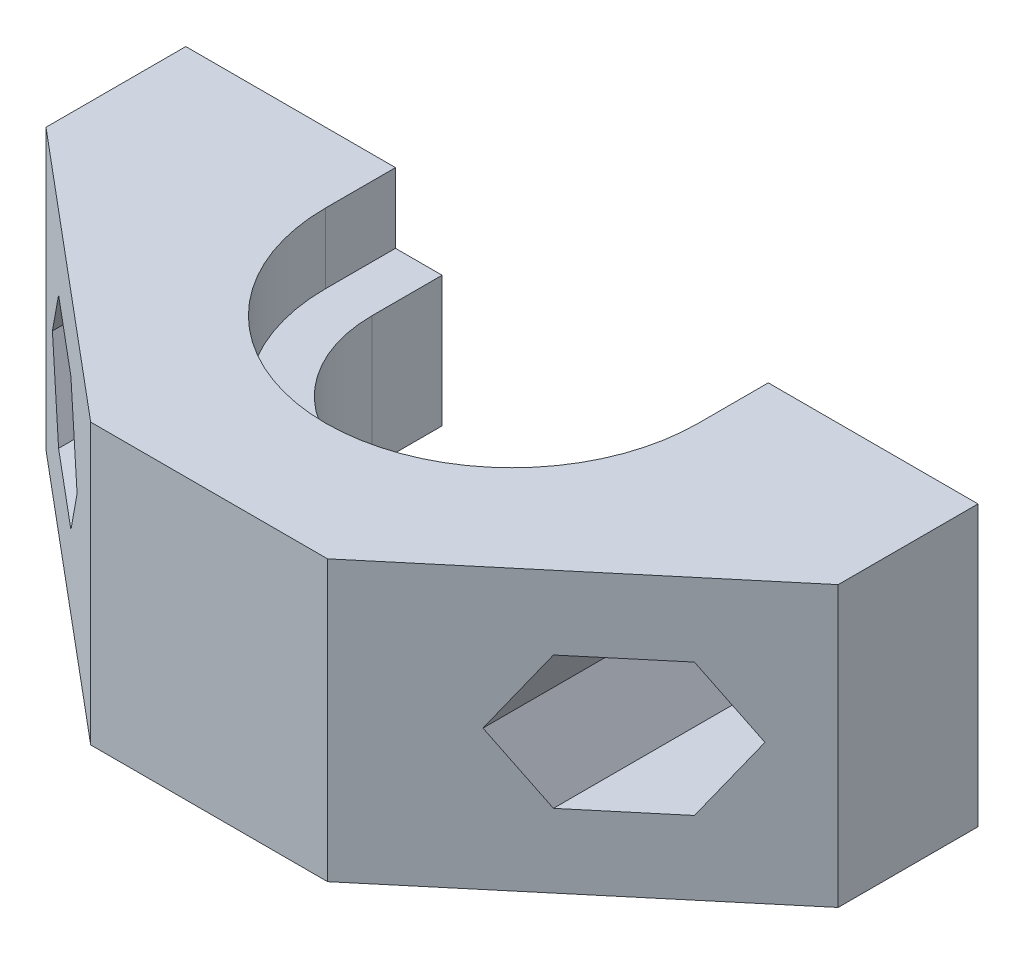
ISO-10303-21;
HEADER;
FILE_DESCRIPTION(('STEP AP214'),'2;1');
FILE_NAME('part.step','',(''),(''),'','','');
FILE_SCHEMA(('AUTOMOTIVE_DESIGN { 1 0 10303 214 1 1 1 1 }'));
ENDSEC;
DATA;
#1=APPLICATION_CONTEXT('core data for automotive mechanical design processes');
#2=APPLICATION_PROTOCOL_DEFINITION('international standard','automotive_design',2000,#1);
#3=PRODUCT_CONTEXT('',#1,'mechanical');
#4=PRODUCT('Part','Part','',(#3));
#5=PRODUCT_RELATED_PRODUCT_CATEGORY('part','',(#4));
#6=PRODUCT_DEFINITION_FORMATION('','',#4);
#7=PRODUCT_DEFINITION_CONTEXT('part definition',#1,'design');
#8=PRODUCT_DEFINITION('design','',#6,#7);
#9=PRODUCT_DEFINITION_SHAPE('','',#8);
#10=(LENGTH_UNIT() NAMED_UNIT(*) SI_UNIT(.MILLI.,.METRE.));
#11=(NAMED_UNIT(*) PLANE_ANGLE_UNIT() SI_UNIT($,.RADIAN.));
#12=(NAMED_UNIT(*) SI_UNIT($,.STERADIAN.) SOLID_ANGLE_UNIT());
#13=UNCERTAINTY_MEASURE_WITH_UNIT(LENGTH_MEASURE(1.E-05),#10,'distance_accuracy_value','');
#14=(GEOMETRIC_REPRESENTATION_CONTEXT(3) GLOBAL_UNCERTAINTY_ASSIGNED_CONTEXT((#13)) GLOBAL_UNIT_ASSIGNED_CONTEXT((#10,
#11,#12)) REPRESENTATION_CONTEXT('',''));
#15=CARTESIAN_POINT('',(0.,0.,0.));
#16=DIRECTION('',(0.,0.,1.));
#17=DIRECTION('',(1.,0.,0.));
#18=AXIS2_PLACEMENT_3D('',#15,#16,#17);
#19=CARTESIAN_POINT('',(0.,3.4,0.));
#20=DIRECTION('',(0.,-1.,0.));
#21=DIRECTION('',(0.,0.,-1.));
#22=AXIS2_PLACEMENT_3D('',#19,#20,#21);
#23=CYLINDRICAL_SURFACE('',#22,8.);
#24=CARTESIAN_POINT('',(0.,0.,0.));
#25=DIRECTION('',(0.,-1.,0.));
#26=DIRECTION('',(0.,0.,1.));
#27=AXIS2_PLACEMENT_3D('',#24,#25,#26);
#28=CIRCLE('',#27,8.);
#29=CARTESIAN_POINT('',(8.,0.,0.));
#30=VERTEX_POINT('',#29);
#31=CARTESIAN_POINT('',(-8.,0.,0.));
#32=VERTEX_POINT('',#31);
#33=EDGE_CURVE('E503',#30,#32,#28,.T.);
#34=ORIENTED_EDGE('',*,*,#33,.T.);
#35=DIRECTION('',(0.,-1.,0.));
#36=VECTOR('',#35,1.);
#37=CARTESIAN_POINT('',(-8.,3.4,0.));
#38=LINE('',#37,#36);
#39=CARTESIAN_POINT('',(-8.,3.4,0.));
#40=VERTEX_POINT('',#39);
#41=EDGE_CURVE('E11',#40,#32,#38,.T.);
#42=ORIENTED_EDGE('',*,*,#41,.F.);
#43=CARTESIAN_POINT('',(0.,3.4,0.));
#44=DIRECTION('',(0.,-1.,0.));
#45=DIRECTION('',(0.,0.,1.));
#46=AXIS2_PLACEMENT_3D('',#43,#44,#45);
#47=CIRCLE('',#46,8.);
#48=CARTESIAN_POINT('',(8.,3.4,0.));
#49=VERTEX_POINT('',#48);
#50=EDGE_CURVE('E504',#49,#40,#47,.T.);
#51=ORIENTED_EDGE('',*,*,#50,.F.);
#52=DIRECTION('',(0.,-1.,0.));
#53=VECTOR('',#52,1.);
#54=CARTESIAN_POINT('',(8.,3.4,0.));
#55=LINE('',#54,#53);
#56=EDGE_CURVE('E521',#49,#30,#55,.T.);
#57=ORIENTED_EDGE('',*,*,#56,.T.);
#58=EDGE_LOOP('',(#34,#42,#51,#57));
#59=FACE_BOUND('',#58,.T.);
#60=ADVANCED_FACE('F39',(#59),#23,.F.);
#61=CARTESIAN_POINT('',(-8.,3.4,-3.));
#62=DIRECTION('',(-1.,0.,0.));
#63=DIRECTION('',(0.,0.,1.));
#64=AXIS2_PLACEMENT_3D('',#61,#62,#63);
#65=PLANE('',#64);
#66=DIRECTION('',(0.,0.,-1.));
#67=VECTOR('',#66,1.);
#68=CARTESIAN_POINT('',(-8.,0.,-3.));
#69=LINE('',#68,#67);
#70=CARTESIAN_POINT('',(-8.,0.,-3.));
#71=VERTEX_POINT('',#70);
#72=EDGE_CURVE('E525',#32,#71,#69,.T.);
#73=ORIENTED_EDGE('',*,*,#72,.T.);
#74=DIRECTION('',(0.,-1.,0.));
#75=VECTOR('',#74,1.);
#76=CARTESIAN_POINT('',(-8.,3.4,-3.));
#77=LINE('',#76,#75);
#78=CARTESIAN_POINT('',(-8.,3.4,-3.));
#79=VERTEX_POINT('',#78);
#80=EDGE_CURVE('E47',#79,#71,#77,.T.);
#81=ORIENTED_EDGE('',*,*,#80,.F.);
#82=DIRECTION('',(0.,0.,-1.));
#83=VECTOR('',#82,1.);
#84=CARTESIAN_POINT('',(-8.,3.4,-3.));
#85=LINE('',#84,#83);
#86=EDGE_CURVE('E508',#40,#79,#85,.T.);
#87=ORIENTED_EDGE('',*,*,#86,.F.);
#88=ORIENTED_EDGE('',*,*,#41,.T.);
#89=EDGE_LOOP('',(#73,#81,#87,#88));
#90=FACE_BOUND('',#89,.T.);
#91=ADVANCED_FACE('F650',(#90),#65,.F.);
#92=CARTESIAN_POINT('',(-17.,3.4,-3.));
#93=DIRECTION('',(0.,0.,1.));
#94=DIRECTION('',(1.,0.,0.));
#95=AXIS2_PLACEMENT_3D('',#92,#93,#94);
#96=PLANE('',#95);
#97=CARTESIAN_POINT('',(-12.,6.,-3.));
#98=DIRECTION('',(0.,0.,-1.));
#99=DIRECTION('',(-1.,0.,0.));
#100=AXIS2_PLACEMENT_3D('',#97,#98,#99);
#101=CIRCLE('',#100,1.65);
#102=CARTESIAN_POINT('',(-13.65,6.,-3.));
#103=VERTEX_POINT('',#102);
#104=EDGE_CURVE('E382',#103,#103,#101,.T.);
#105=ORIENTED_EDGE('',*,*,#104,.F.);
#106=EDGE_LOOP('',(#105));
#107=FACE_BOUND('',#106,.T.);
#108=DIRECTION('',(-1.,0.,0.));
#109=VECTOR('',#108,1.);
#110=CARTESIAN_POINT('',(-17.,0.,-3.));
#111=LINE('',#110,#109);
#112=CARTESIAN_POINT('',(-17.,0.,-3.));
#113=VERTEX_POINT('',#112);
#114=EDGE_CURVE('E528',#71,#113,#111,.T.);
#115=ORIENTED_EDGE('',*,*,#114,.T.);
#116=DIRECTION('',(0.,-1.,0.));
#117=VECTOR('',#116,1.);
#118=CARTESIAN_POINT('',(-17.,3.4,-3.));
#119=LINE('',#118,#117);
#120=CARTESIAN_POINT('',(-17.,12.,-3.));
#121=VERTEX_POINT('',#120);
#122=EDGE_CURVE('E586',#121,#113,#119,.T.);
#123=ORIENTED_EDGE('',*,*,#122,.F.);
#124=DIRECTION('',(-1.,0.,0.));
#125=VECTOR('',#124,1.);
#126=CARTESIAN_POINT('',(-8.,12.,-3.));
#127=LINE('',#126,#125);
#128=CARTESIAN_POINT('',(-8.,12.,-3.));
#129=VERTEX_POINT('',#128);
#130=EDGE_CURVE('E398',#129,#121,#127,.T.);
#131=ORIENTED_EDGE('',*,*,#130,.F.);
#132=DIRECTION('',(0.,-1.,0.));
#133=VECTOR('',#132,1.);
#134=CARTESIAN_POINT('',(-8.,12.,-3.));
#135=LINE('',#134,#133);
#136=CARTESIAN_POINT('',(-8.,9.,-3.));
#137=VERTEX_POINT('',#136);
#138=EDGE_CURVE('E446',#129,#137,#135,.T.);
#139=ORIENTED_EDGE('',*,*,#138,.T.);
#140=DIRECTION('',(-1.,0.,0.));
#141=VECTOR('',#140,1.);
#142=CARTESIAN_POINT('',(-6.,9.,-3.));
#143=LINE('',#142,#141);
#144=CARTESIAN_POINT('',(-6.,9.,-3.));
#145=VERTEX_POINT('',#144);
#146=EDGE_CURVE('E463',#145,#137,#143,.T.);
#147=ORIENTED_EDGE('',*,*,#146,.F.);
#148=DIRECTION('',(0.,-1.,0.));
#149=VECTOR('',#148,1.);
#150=CARTESIAN_POINT('',(-6.,9.,-3.));
#151=LINE('',#150,#149);
#152=CARTESIAN_POINT('',(-6.,3.4,-3.));
#153=VERTEX_POINT('',#152);
#154=EDGE_CURVE('E495',#145,#153,#151,.T.);
#155=ORIENTED_EDGE('',*,*,#154,.T.);
#156=DIRECTION('',(-1.,0.,0.));
#157=VECTOR('',#156,1.);
#158=CARTESIAN_POINT('',(-6.,3.4,-3.));
#159=LINE('',#158,#157);
#160=EDGE_CURVE('E479',#153,#79,#159,.T.);
#161=ORIENTED_EDGE('',*,*,#160,.T.);
#162=ORIENTED_EDGE('',*,*,#80,.T.);
#163=EDGE_LOOP('',(#115,#123,#131,#139,#147,#155,#161,#162));
#164=FACE_BOUND('',#163,.T.);
#165=ADVANCED_FACE('F593',(#107,#164),#96,.F.);
#166=CARTESIAN_POINT('',(-17.,3.4,3.));
#167=DIRECTION('',(1.,0.,0.));
#168=DIRECTION('',(0.,0.,-1.));
#169=AXIS2_PLACEMENT_3D('',#166,#167,#168);
#170=PLANE('',#169);
#171=DIRECTION('',(0.,0.,1.));
#172=VECTOR('',#171,1.);
#173=CARTESIAN_POINT('',(-17.,0.,3.));
#174=LINE('',#173,#172);
#175=CARTESIAN_POINT('',(-17.,0.,3.));
#176=VERTEX_POINT('',#175);
#177=EDGE_CURVE('E531',#113,#176,#174,.T.);
#178=ORIENTED_EDGE('',*,*,#177,.T.);
#179=DIRECTION('',(0.,-1.,0.));
#180=VECTOR('',#179,1.);
#181=CARTESIAN_POINT('',(-17.,3.4,3.));
#182=LINE('',#181,#180);
#183=CARTESIAN_POINT('',(-17.,12.,3.));
#184=VERTEX_POINT('',#183);
#185=EDGE_CURVE('E582',#184,#176,#182,.T.);
#186=ORIENTED_EDGE('',*,*,#185,.F.);
#187=DIRECTION('',(0.,0.,1.));
#188=VECTOR('',#187,1.);
#189=CARTESIAN_POINT('',(-17.,12.,-3.));
#190=LINE('',#189,#188);
#191=EDGE_CURVE('E402',#121,#184,#190,.T.);
#192=ORIENTED_EDGE('',*,*,#191,.F.);
#193=ORIENTED_EDGE('',*,*,#122,.T.);
#194=EDGE_LOOP('',(#178,#186,#192,#193));
#195=FACE_BOUND('',#194,.T.);
#196=ADVANCED_FACE('F603',(#195),#170,.F.);
#197=CARTESIAN_POINT('',(-17.,3.4,3.));
#198=DIRECTION('',(0.64278760968654,0.,-0.766044443118977));
#199=DIRECTION('',(-0.766044443118977,0.,-0.64278760968654));
#200=AXIS2_PLACEMENT_3D('',#197,#198,#199);
#201=PLANE('',#200);
#202=DIRECTION('',(-0.461065123950812,0.79858822028085,-0.386879575455835));
#203=VECTOR('',#202,1.);
#204=CARTESIAN_POINT('',(-9.5652693870053,7.48292287554986,9.23847971526631));
#205=LINE('',#204,#203);
#206=CARTESIAN_POINT('',(-8.70910346561913,6.,9.956888224128));
#207=VERTEX_POINT('',#206);
#208=CARTESIAN_POINT('',(-10.3545517328096,8.85,8.5761931900072));
#209=VERTEX_POINT('',#208);
#210=EDGE_CURVE('E269',#207,#209,#205,.T.);
#211=ORIENTED_EDGE('',*,*,#210,.F.);
#212=DIRECTION('',(0.461065123950813,0.79858822028085,0.386879575455835));
#213=VECTOR('',#212,1.);
#214=CARTESIAN_POINT('',(-8.16610491528139,6.94050107762122,10.4125181074462));
#215=LINE('',#214,#213);
#216=CARTESIAN_POINT('',(-10.3545517328096,3.15,8.5761931900072));
#217=VERTEX_POINT('',#216);
#218=EDGE_CURVE('E246',#217,#207,#215,.T.);
#219=ORIENTED_EDGE('',*,*,#218,.F.);
#220=DIRECTION('',(0.766044443118977,0.,0.64278760968654));
#221=VECTOR('',#220,1.);
#222=CARTESIAN_POINT('',(-8.17575970677851,3.15,10.4044167754619));
#223=LINE('',#222,#221);
#224=CARTESIAN_POINT('',(-13.6454482671904,3.15,5.81480312176562));
#225=VERTEX_POINT('',#224);
#226=EDGE_CURVE('E258',#225,#217,#223,.T.);
#227=ORIENTED_EDGE('',*,*,#226,.F.);
#228=DIRECTION('',(0.461065123950812,-0.79858822028085,0.386879575455835));
#229=VECTOR('',#228,1.);
#230=CARTESIAN_POINT('',(-12.3635983304531,0.929770781892,6.89040293090654));
#231=LINE('',#230,#229);
#232=CARTESIAN_POINT('',(-15.2908965343809,6.,4.43410808764483));
#233=VERTEX_POINT('',#232);
#234=EDGE_CURVE('E54',#233,#225,#231,.T.);
#235=ORIENTED_EDGE('',*,*,#234,.F.);
#236=DIRECTION('',(-0.461065123950813,-0.798588220280849,-0.386879575455835));
#237=VECTOR('',#236,1.);
#238=CARTESIAN_POINT('',(-13.762762802177,8.64680526493693,5.71636453872665));
#239=LINE('',#238,#237);
#240=CARTESIAN_POINT('',(-13.6454482671904,8.85,5.81480312176562));
#241=VERTEX_POINT('',#240);
#242=EDGE_CURVE('E1005',#241,#233,#239,.T.);
#243=ORIENTED_EDGE('',*,*,#242,.F.);
#244=DIRECTION('',(-0.766044443118977,0.,-0.64278760968654));
#245=VECTOR('',#244,1.);
#246=CARTESIAN_POINT('',(-10.1069370670118,8.85,8.78396656475223));
#247=LINE('',#246,#245);
#248=EDGE_CURVE('E276',#209,#241,#247,.T.);
#249=ORIENTED_EDGE('',*,*,#248,.F.);
#250=EDGE_LOOP('',(#211,#219,#227,#235,#243,#249));
#251=FACE_BOUND('',#250,.T.);
#252=DIRECTION('',(0.766044443118977,0.,0.64278760968654));
#253=VECTOR('',#252,1.);
#254=CARTESIAN_POINT('',(-17.,0.,3.));
#255=LINE('',#254,#253);
#256=CARTESIAN_POINT('',(-5.08246407405794,0.,13.));
#257=VERTEX_POINT('',#256);
#258=EDGE_CURVE('E534',#176,#257,#255,.T.);
#259=ORIENTED_EDGE('',*,*,#258,.T.);
#260=DIRECTION('',(0.,-1.,0.));
#261=VECTOR('',#260,1.);
#262=CARTESIAN_POINT('',(-5.08246407405794,3.4,13.));
#263=LINE('',#262,#261);
#264=CARTESIAN_POINT('',(-5.08246407405794,12.,13.));
#265=VERTEX_POINT('',#264);
#266=EDGE_CURVE('E578',#265,#257,#263,.T.);
#267=ORIENTED_EDGE('',*,*,#266,.F.);
#268=DIRECTION('',(0.766044443118977,0.,0.64278760968654));
#269=VECTOR('',#268,1.);
#270=CARTESIAN_POINT('',(-17.,12.,3.));
#271=LINE('',#270,#269);
#272=EDGE_CURVE('E406',#184,#265,#271,.T.);
#273=ORIENTED_EDGE('',*,*,#272,.F.);
#274=ORIENTED_EDGE('',*,*,#185,.T.);
#275=EDGE_LOOP('',(#259,#267,#273,#274));
#276=FACE_BOUND('',#275,.T.);
#277=ADVANCED_FACE('F265',(#251,#276),#201,.F.);
#278=CARTESIAN_POINT('',(-5.08246407405794,3.4,13.));
#279=DIRECTION('',(0.,0.,-1.));
#280=DIRECTION('',(-1.,0.,0.));
#281=AXIS2_PLACEMENT_3D('',#278,#279,#280);
#282=PLANE('',#281);
#283=DIRECTION('',(1.,0.,0.));
#284=VECTOR('',#283,1.);
#285=CARTESIAN_POINT('',(-5.08246407405794,0.,13.));
#286=LINE('',#285,#284);
#287=CARTESIAN_POINT('',(5.08246407405793,0.,13.));
#288=VERTEX_POINT('',#287);
#289=EDGE_CURVE('E537',#257,#288,#286,.T.);
#290=ORIENTED_EDGE('',*,*,#289,.T.);
#291=DIRECTION('',(0.,-1.,0.));
#292=VECTOR('',#291,1.);
#293=CARTESIAN_POINT('',(5.08246407405793,3.4,13.));
#294=LINE('',#293,#292);
#295=CARTESIAN_POINT('',(5.08246407405793,12.,13.));
#296=VERTEX_POINT('',#295);
#297=EDGE_CURVE('E574',#296,#288,#294,.T.);
#298=ORIENTED_EDGE('',*,*,#297,.F.);
#299=DIRECTION('',(1.,0.,0.));
#300=VECTOR('',#299,1.);
#301=CARTESIAN_POINT('',(-5.08246407405794,12.,13.));
#302=LINE('',#301,#300);
#303=EDGE_CURVE('E410',#265,#296,#302,.T.);
#304=ORIENTED_EDGE('',*,*,#303,.F.);
#305=ORIENTED_EDGE('',*,*,#266,.T.);
#306=EDGE_LOOP('',(#290,#298,#304,#305));
#307=FACE_BOUND('',#306,.T.);
#308=ADVANCED_FACE('F611',(#307),#282,.F.);
#309=CARTESIAN_POINT('',(5.08246407405793,3.4,13.));
#310=DIRECTION('',(-0.64278760968654,0.,-0.766044443118977));
#311=DIRECTION('',(-0.766044443118977,0.,0.64278760968654));
#312=AXIS2_PLACEMENT_3D('',#309,#310,#311);
#313=PLANE('',#312);
#314=DIRECTION('',(-0.461065123950812,0.79858822028085,0.386879575455834));
#315=VECTOR('',#314,1.);
#316=CARTESIAN_POINT('',(12.3635983304531,11.070229218108,6.89040293090653));
#317=LINE('',#316,#315);
#318=CARTESIAN_POINT('',(15.2908965343809,6.,4.43410808764483));
#319=VERTEX_POINT('',#318);
#320=CARTESIAN_POINT('',(13.6454482671904,8.85,5.81480312176562));
#321=VERTEX_POINT('',#320);
#322=EDGE_CURVE('E326',#319,#321,#317,.T.);
#323=ORIENTED_EDGE('',*,*,#322,.F.);
#324=DIRECTION('',(0.461065123950813,0.79858822028085,-0.386879575455835));
#325=VECTOR('',#324,1.);
#326=CARTESIAN_POINT('',(13.762762802177,3.35319473506307,5.71636453872665));
#327=LINE('',#326,#325);
#328=CARTESIAN_POINT('',(13.6454482671904,3.15,5.81480312176562));
#329=VERTEX_POINT('',#328);
#330=EDGE_CURVE('E330',#329,#319,#327,.T.);
#331=ORIENTED_EDGE('',*,*,#330,.F.);
#332=DIRECTION('',(0.766044443118977,0.,-0.64278760968654));
#333=VECTOR('',#332,1.);
#334=CARTESIAN_POINT('',(10.1069370670118,3.15,8.78396656475222));
#335=LINE('',#334,#333);
#336=CARTESIAN_POINT('',(10.3545517328096,3.15,8.5761931900072));
#337=VERTEX_POINT('',#336);
#338=EDGE_CURVE('E313',#337,#329,#335,.T.);
#339=ORIENTED_EDGE('',*,*,#338,.F.);
#340=DIRECTION('',(0.461065123950812,-0.79858822028085,-0.386879575455834));
#341=VECTOR('',#340,1.);
#342=CARTESIAN_POINT('',(9.5652693870053,4.51707712445014,9.2384797152663));
#343=LINE('',#342,#341);
#344=CARTESIAN_POINT('',(8.70910346561913,6.,9.95688822412799));
#345=VERTEX_POINT('',#344);
#346=EDGE_CURVE('E62',#345,#337,#343,.T.);
#347=ORIENTED_EDGE('',*,*,#346,.F.);
#348=DIRECTION('',(-0.461065123950813,-0.798588220280849,0.386879575455835));
#349=VECTOR('',#348,1.);
#350=CARTESIAN_POINT('',(8.16610491528139,5.05949892237878,10.4125181074462));
#351=LINE('',#350,#349);
#352=CARTESIAN_POINT('',(10.3545517328096,8.85,8.5761931900072));
#353=VERTEX_POINT('',#352);
#354=EDGE_CURVE('E317',#353,#345,#351,.T.);
#355=ORIENTED_EDGE('',*,*,#354,.F.);
#356=DIRECTION('',(-0.766044443118977,0.,0.64278760968654));
#357=VECTOR('',#356,1.);
#358=CARTESIAN_POINT('',(8.17575970677851,8.85,10.4044167754619));
#359=LINE('',#358,#357);
#360=EDGE_CURVE('E322',#321,#353,#359,.T.);
#361=ORIENTED_EDGE('',*,*,#360,.F.);
#362=EDGE_LOOP('',(#323,#331,#339,#347,#355,#361));
#363=FACE_BOUND('',#362,.T.);
#364=DIRECTION('',(0.766044443118977,0.,-0.64278760968654));
#365=VECTOR('',#364,1.);
#366=CARTESIAN_POINT('',(5.08246407405793,0.,13.));
#367=LINE('',#366,#365);
#368=CARTESIAN_POINT('',(17.,0.,3.));
#369=VERTEX_POINT('',#368);
#370=EDGE_CURVE('E540',#288,#369,#367,.T.);
#371=ORIENTED_EDGE('',*,*,#370,.T.);
#372=DIRECTION('',(0.,-1.,0.));
#373=VECTOR('',#372,1.);
#374=CARTESIAN_POINT('',(17.,3.4,3.));
#375=LINE('',#374,#373);
#376=CARTESIAN_POINT('',(17.,12.,3.));
#377=VERTEX_POINT('',#376);
#378=EDGE_CURVE('E570',#377,#369,#375,.T.);
#379=ORIENTED_EDGE('',*,*,#378,.F.);
#380=DIRECTION('',(0.766044443118977,0.,-0.64278760968654));
#381=VECTOR('',#380,1.);
#382=CARTESIAN_POINT('',(5.08246407405793,12.,13.));
#383=LINE('',#382,#381);
#384=EDGE_CURVE('E414',#296,#377,#383,.T.);
#385=ORIENTED_EDGE('',*,*,#384,.F.);
#386=ORIENTED_EDGE('',*,*,#297,.T.);
#387=EDGE_LOOP('',(#371,#379,#385,#386));
#388=FACE_BOUND('',#387,.T.);
#389=ADVANCED_FACE('F614',(#363,#388),#313,.F.);
#390=CARTESIAN_POINT('',(17.,3.4,0.));
#391=DIRECTION('',(-1.,0.,0.));
#392=DIRECTION('',(0.,0.,1.));
#393=AXIS2_PLACEMENT_3D('',#390,#391,#392);
#394=PLANE('',#393);
#395=DIRECTION('',(0.,0.,-1.));
#396=VECTOR('',#395,1.);
#397=CARTESIAN_POINT('',(17.,0.,0.));
#398=LINE('',#397,#396);
#399=CARTESIAN_POINT('',(17.,0.,-3.));
#400=VERTEX_POINT('',#399);
#401=EDGE_CURVE('E544',#369,#400,#398,.T.);
#402=ORIENTED_EDGE('',*,*,#401,.T.);
#403=DIRECTION('',(0.,-1.,0.));
#404=VECTOR('',#403,1.);
#405=CARTESIAN_POINT('',(17.,3.4,-3.));
#406=LINE('',#405,#404);
#407=CARTESIAN_POINT('',(17.,12.,-3.));
#408=VERTEX_POINT('',#407);
#409=EDGE_CURVE('E566',#408,#400,#406,.T.);
#410=ORIENTED_EDGE('',*,*,#409,.F.);
#411=DIRECTION('',(0.,0.,-1.));
#412=VECTOR('',#411,1.);
#413=CARTESIAN_POINT('',(17.,12.,3.));
#414=LINE('',#413,#412);
#415=EDGE_CURVE('E418',#377,#408,#414,.T.);
#416=ORIENTED_EDGE('',*,*,#415,.F.);
#417=ORIENTED_EDGE('',*,*,#378,.T.);
#418=EDGE_LOOP('',(#402,#410,#416,#417));
#419=FACE_BOUND('',#418,.T.);
#420=ADVANCED_FACE('F618',(#419),#394,.F.);
#421=CARTESIAN_POINT('',(17.,3.4,-3.));
#422=DIRECTION('',(0.,0.,1.));
#423=DIRECTION('',(1.,0.,0.));
#424=AXIS2_PLACEMENT_3D('',#421,#422,#423);
#425=PLANE('',#424);
#426=CARTESIAN_POINT('',(12.,6.,-3.));
#427=DIRECTION('',(0.,0.,-1.));
#428=DIRECTION('',(-1.,0.,0.));
#429=AXIS2_PLACEMENT_3D('',#426,#427,#428);
#430=CIRCLE('',#429,1.65);
#431=CARTESIAN_POINT('',(10.35,6.,-3.));
#432=VERTEX_POINT('',#431);
#433=EDGE_CURVE('E262',#432,#432,#430,.T.);
#434=ORIENTED_EDGE('',*,*,#433,.F.);
#435=EDGE_LOOP('',(#434));
#436=FACE_BOUND('',#435,.T.);
#437=DIRECTION('',(-1.,0.,0.));
#438=VECTOR('',#437,1.);
#439=CARTESIAN_POINT('',(17.,0.,-3.));
#440=LINE('',#439,#438);
#441=CARTESIAN_POINT('',(7.9844910677045,0.,-3.));
#442=VERTEX_POINT('',#441);
#443=EDGE_CURVE('E547',#400,#442,#440,.T.);
#444=ORIENTED_EDGE('',*,*,#443,.T.);
#445=DIRECTION('',(0.,-1.,0.));
#446=VECTOR('',#445,1.);
#447=CARTESIAN_POINT('',(7.9844910677045,3.4,-3.));
#448=LINE('',#447,#446);
#449=CARTESIAN_POINT('',(7.9844910677045,3.4,-3.));
#450=VERTEX_POINT('',#449);
#451=EDGE_CURVE('E562',#450,#442,#448,.T.);
#452=ORIENTED_EDGE('',*,*,#451,.F.);
#453=DIRECTION('',(-1.,0.,0.));
#454=VECTOR('',#453,1.);
#455=CARTESIAN_POINT('',(17.,3.4,-3.));
#456=LINE('',#455,#454);
#457=CARTESIAN_POINT('',(6.,3.4,-3.));
#458=VERTEX_POINT('',#457);
#459=EDGE_CURVE('E483',#450,#458,#456,.T.);
#460=ORIENTED_EDGE('',*,*,#459,.T.);
#461=DIRECTION('',(0.,-1.,0.));
#462=VECTOR('',#461,1.);
#463=CARTESIAN_POINT('',(6.,9.,-3.));
#464=LINE('',#463,#462);
#465=CARTESIAN_POINT('',(6.,9.,-3.));
#466=VERTEX_POINT('',#465);
#467=EDGE_CURVE('E491',#466,#458,#464,.T.);
#468=ORIENTED_EDGE('',*,*,#467,.F.);
#469=DIRECTION('',(-1.,0.,0.));
#470=VECTOR('',#469,1.);
#471=CARTESIAN_POINT('',(17.,9.,-3.));
#472=LINE('',#471,#470);
#473=CARTESIAN_POINT('',(8.,9.,-3.));
#474=VERTEX_POINT('',#473);
#475=EDGE_CURVE('E466',#474,#466,#472,.T.);
#476=ORIENTED_EDGE('',*,*,#475,.F.);
#477=DIRECTION('',(0.,-1.,0.));
#478=VECTOR('',#477,1.);
#479=CARTESIAN_POINT('',(8.,12.,-3.));
#480=LINE('',#479,#478);
#481=CARTESIAN_POINT('',(8.,12.,-3.));
#482=VERTEX_POINT('',#481);
#483=EDGE_CURVE('E442',#482,#474,#480,.T.);
#484=ORIENTED_EDGE('',*,*,#483,.F.);
#485=DIRECTION('',(-1.,0.,0.));
#486=VECTOR('',#485,1.);
#487=CARTESIAN_POINT('',(17.,12.,-3.));
#488=LINE('',#487,#486);
#489=EDGE_CURVE('E422',#408,#482,#488,.T.);
#490=ORIENTED_EDGE('',*,*,#489,.F.);
#491=ORIENTED_EDGE('',*,*,#409,.T.);
#492=EDGE_LOOP('',(#444,#452,#460,#468,#476,#484,#490,#491));
#493=FACE_BOUND('',#492,.T.);
#494=ADVANCED_FACE('F622',(#436,#493),#425,.F.);
#495=CARTESIAN_POINT('',(7.9844910677045,3.4,-3.));
#496=DIRECTION('',(1.,0.,0.));
#497=DIRECTION('',(0.,0.,-1.));
#498=AXIS2_PLACEMENT_3D('',#495,#496,#497);
#499=PLANE('',#498);
#500=DIRECTION('',(0.,0.,1.));
#501=VECTOR('',#500,1.);
#502=CARTESIAN_POINT('',(7.9844910677045,0.,-3.));
#503=LINE('',#502,#501);
#504=CARTESIAN_POINT('',(7.9844910677045,0.,0.));
#505=VERTEX_POINT('',#504);
#506=EDGE_CURVE('E550',#442,#505,#503,.T.);
#507=ORIENTED_EDGE('',*,*,#506,.T.);
#508=DIRECTION('',(0.,-1.,0.));
#509=VECTOR('',#508,1.);
#510=CARTESIAN_POINT('',(7.9844910677045,3.4,0.));
#511=LINE('',#510,#509);
#512=CARTESIAN_POINT('',(7.9844910677045,3.4,0.));
#513=VERTEX_POINT('',#512);
#514=EDGE_CURVE('E558',#513,#505,#511,.T.);
#515=ORIENTED_EDGE('',*,*,#514,.F.);
#516=DIRECTION('',(0.,0.,1.));
#517=VECTOR('',#516,1.);
#518=CARTESIAN_POINT('',(7.9844910677045,3.4,-3.));
#519=LINE('',#518,#517);
#520=EDGE_CURVE('E513',#450,#513,#519,.T.);
#521=ORIENTED_EDGE('',*,*,#520,.F.);
#522=ORIENTED_EDGE('',*,*,#451,.T.);
#523=EDGE_LOOP('',(#507,#515,#521,#522));
#524=FACE_BOUND('',#523,.T.);
#525=ADVANCED_FACE('F659',(#524),#499,.F.);
#526=CARTESIAN_POINT('',(8.,3.4,0.));
#527=DIRECTION('',(0.,0.,-1.));
#528=DIRECTION('',(-1.,0.,0.));
#529=AXIS2_PLACEMENT_3D('',#526,#527,#528);
#530=PLANE('',#529);
#531=DIRECTION('',(1.,0.,0.));
#532=VECTOR('',#531,1.);
#533=CARTESIAN_POINT('',(8.,0.,0.));
#534=LINE('',#533,#532);
#535=EDGE_CURVE('E509',#505,#30,#534,.T.);
#536=ORIENTED_EDGE('',*,*,#535,.T.);
#537=ORIENTED_EDGE('',*,*,#56,.F.);
#538=DIRECTION('',(1.,0.,0.));
#539=VECTOR('',#538,1.);
#540=CARTESIAN_POINT('',(8.,3.4,0.));
#541=LINE('',#540,#539);
#542=EDGE_CURVE('E517',#513,#49,#541,.T.);
#543=ORIENTED_EDGE('',*,*,#542,.F.);
#544=ORIENTED_EDGE('',*,*,#514,.T.);
#545=EDGE_LOOP('',(#536,#537,#543,#544));
#546=FACE_BOUND('',#545,.T.);
#547=ADVANCED_FACE('F655',(#546),#530,.F.);
#548=CARTESIAN_POINT('',(0.,0.,0.));
#549=DIRECTION('',(0.,1.,0.));
#550=DIRECTION('',(0.,0.,1.));
#551=AXIS2_PLACEMENT_3D('',#548,#549,#550);
#552=PLANE('',#551);
#553=ORIENTED_EDGE('',*,*,#33,.F.);
#554=ORIENTED_EDGE('',*,*,#535,.F.);
#555=ORIENTED_EDGE('',*,*,#506,.F.);
#556=ORIENTED_EDGE('',*,*,#443,.F.);
#557=ORIENTED_EDGE('',*,*,#401,.F.);
#558=ORIENTED_EDGE('',*,*,#370,.F.);
#559=ORIENTED_EDGE('',*,*,#289,.F.);
#560=ORIENTED_EDGE('',*,*,#258,.F.);
#561=ORIENTED_EDGE('',*,*,#177,.F.);
#562=ORIENTED_EDGE('',*,*,#114,.F.);
#563=ORIENTED_EDGE('',*,*,#72,.F.);
#564=EDGE_LOOP('',(#553,#554,#555,#556,#557,#558,#559,#560,#561,#562,#563));
#565=FACE_BOUND('',#564,.T.);
#566=ADVANCED_FACE('F599',(#565),#552,.F.);
#567=CARTESIAN_POINT('',(0.,3.4,0.));
#568=DIRECTION('',(0.,1.,0.));
#569=DIRECTION('',(0.,0.,1.));
#570=AXIS2_PLACEMENT_3D('',#567,#568,#569);
#571=PLANE('',#570);
#572=ORIENTED_EDGE('',*,*,#50,.T.);
#573=ORIENTED_EDGE('',*,*,#86,.T.);
#574=ORIENTED_EDGE('',*,*,#160,.F.);
#575=DIRECTION('',(0.,0.,-1.));
#576=VECTOR('',#575,1.);
#577=CARTESIAN_POINT('',(-6.,3.4,0.));
#578=LINE('',#577,#576);
#579=CARTESIAN_POINT('',(-6.,3.4,0.));
#580=VERTEX_POINT('',#579);
#581=EDGE_CURVE('E476',#580,#153,#578,.T.);
#582=ORIENTED_EDGE('',*,*,#581,.F.);
#583=CARTESIAN_POINT('',(0.,3.4,0.));
#584=DIRECTION('',(0.,-1.,0.));
#585=DIRECTION('',(0.,0.,1.));
#586=AXIS2_PLACEMENT_3D('',#583,#584,#585);
#587=CIRCLE('',#586,6.);
#588=CARTESIAN_POINT('',(6.,3.4,0.));
#589=VERTEX_POINT('',#588);
#590=EDGE_CURVE('E454',#589,#580,#587,.T.);
#591=ORIENTED_EDGE('',*,*,#590,.F.);
#592=DIRECTION('',(0.,0.,1.));
#593=VECTOR('',#592,1.);
#594=CARTESIAN_POINT('',(6.,3.4,-3.));
#595=LINE('',#594,#593);
#596=EDGE_CURVE('E460',#458,#589,#595,.T.);
#597=ORIENTED_EDGE('',*,*,#596,.F.);
#598=ORIENTED_EDGE('',*,*,#459,.F.);
#599=ORIENTED_EDGE('',*,*,#520,.T.);
#600=ORIENTED_EDGE('',*,*,#542,.T.);
#601=EDGE_LOOP('',(#572,#573,#574,#582,#591,#597,#598,#599,#600));
#602=FACE_BOUND('',#601,.T.);
#603=ADVANCED_FACE('F647',(#602),#571,.F.);
#604=CARTESIAN_POINT('',(0.,9.,0.));
#605=DIRECTION('',(0.,-1.,0.));
#606=DIRECTION('',(0.,0.,-1.));
#607=AXIS2_PLACEMENT_3D('',#604,#605,#606);
#608=CYLINDRICAL_SURFACE('',#607,6.);
#609=ORIENTED_EDGE('',*,*,#590,.T.);
#610=DIRECTION('',(0.,-1.,0.));
#611=VECTOR('',#610,1.);
#612=CARTESIAN_POINT('',(-6.,9.,0.));
#613=LINE('',#612,#611);
#614=CARTESIAN_POINT('',(-6.,9.,0.));
#615=VERTEX_POINT('',#614);
#616=EDGE_CURVE('E499',#615,#580,#613,.T.);
#617=ORIENTED_EDGE('',*,*,#616,.F.);
#618=CARTESIAN_POINT('',(0.,9.,0.));
#619=DIRECTION('',(0.,-1.,0.));
#620=DIRECTION('',(0.,0.,1.));
#621=AXIS2_PLACEMENT_3D('',#618,#619,#620);
#622=CIRCLE('',#621,6.);
#623=CARTESIAN_POINT('',(6.,9.,0.));
#624=VERTEX_POINT('',#623);
#625=EDGE_CURVE('E455',#624,#615,#622,.T.);
#626=ORIENTED_EDGE('',*,*,#625,.F.);
#627=DIRECTION('',(0.,-1.,0.));
#628=VECTOR('',#627,1.);
#629=CARTESIAN_POINT('',(6.,9.,0.));
#630=LINE('',#629,#628);
#631=EDGE_CURVE('E472',#624,#589,#630,.T.);
#632=ORIENTED_EDGE('',*,*,#631,.T.);
#633=EDGE_LOOP('',(#609,#617,#626,#632));
#634=FACE_BOUND('',#633,.T.);
#635=ADVANCED_FACE('F667',(#634),#608,.F.);
#636=CARTESIAN_POINT('',(-6.,9.,0.));
#637=DIRECTION('',(-1.,0.,0.));
#638=DIRECTION('',(0.,0.,1.));
#639=AXIS2_PLACEMENT_3D('',#636,#637,#638);
#640=PLANE('',#639);
#641=ORIENTED_EDGE('',*,*,#581,.T.);
#642=ORIENTED_EDGE('',*,*,#154,.F.);
#643=DIRECTION('',(0.,0.,-1.));
#644=VECTOR('',#643,1.);
#645=CARTESIAN_POINT('',(-6.,9.,0.));
#646=LINE('',#645,#644);
#647=EDGE_CURVE('E459',#615,#145,#646,.T.);
#648=ORIENTED_EDGE('',*,*,#647,.F.);
#649=ORIENTED_EDGE('',*,*,#616,.T.);
#650=EDGE_LOOP('',(#641,#642,#648,#649));
#651=FACE_BOUND('',#650,.T.);
#652=ADVANCED_FACE('F644',(#651),#640,.F.);
#653=CARTESIAN_POINT('',(6.,9.,-3.));
#654=DIRECTION('',(1.,0.,0.));
#655=DIRECTION('',(0.,0.,-1.));
#656=AXIS2_PLACEMENT_3D('',#653,#654,#655);
#657=PLANE('',#656);
#658=ORIENTED_EDGE('',*,*,#596,.T.);
#659=ORIENTED_EDGE('',*,*,#631,.F.);
#660=DIRECTION('',(0.,0.,1.));
#661=VECTOR('',#660,1.);
#662=CARTESIAN_POINT('',(6.,9.,-3.));
#663=LINE('',#662,#661);
#664=EDGE_CURVE('E469',#466,#624,#663,.T.);
#665=ORIENTED_EDGE('',*,*,#664,.F.);
#666=ORIENTED_EDGE('',*,*,#467,.T.);
#667=EDGE_LOOP('',(#658,#659,#665,#666));
#668=FACE_BOUND('',#667,.T.);
#669=ADVANCED_FACE('F664',(#668),#657,.F.);
#670=CARTESIAN_POINT('',(0.,9.,0.));
#671=DIRECTION('',(0.,1.,0.));
#672=DIRECTION('',(0.,0.,1.));
#673=AXIS2_PLACEMENT_3D('',#670,#671,#672);
#674=PLANE('',#673);
#675=DIRECTION('',(0.,0.,1.));
#676=VECTOR('',#675,1.);
#677=CARTESIAN_POINT('',(8.,9.,-3.));
#678=LINE('',#677,#676);
#679=CARTESIAN_POINT('',(8.,9.,0.));
#680=VERTEX_POINT('',#679);
#681=EDGE_CURVE('E395',#474,#680,#678,.T.);
#682=ORIENTED_EDGE('',*,*,#681,.F.);
#683=ORIENTED_EDGE('',*,*,#475,.T.);
#684=ORIENTED_EDGE('',*,*,#664,.T.);
#685=ORIENTED_EDGE('',*,*,#625,.T.);
#686=ORIENTED_EDGE('',*,*,#647,.T.);
#687=ORIENTED_EDGE('',*,*,#146,.T.);
#688=DIRECTION('',(0.,0.,-1.));
#689=VECTOR('',#688,1.);
#690=CARTESIAN_POINT('',(-8.,9.,0.));
#691=LINE('',#690,#689);
#692=CARTESIAN_POINT('',(-8.,9.,0.));
#693=VERTEX_POINT('',#692);
#694=EDGE_CURVE('E432',#693,#137,#691,.T.);
#695=ORIENTED_EDGE('',*,*,#694,.F.);
#696=CARTESIAN_POINT('',(0.,9.,0.));
#697=DIRECTION('',(0.,-1.,0.));
#698=DIRECTION('',(0.,0.,1.));
#699=AXIS2_PLACEMENT_3D('',#696,#697,#698);
#700=CIRCLE('',#699,8.);
#701=EDGE_CURVE('E386',#680,#693,#700,.T.);
#702=ORIENTED_EDGE('',*,*,#701,.F.);
#703=EDGE_LOOP('',(#682,#683,#684,#685,#686,#687,#695,#702));
#704=FACE_BOUND('',#703,.T.);
#705=ADVANCED_FACE('F640',(#704),#674,.T.);
#706=CARTESIAN_POINT('',(0.,12.,0.));
#707=DIRECTION('',(0.,-1.,0.));
#708=DIRECTION('',(0.,0.,-1.));
#709=AXIS2_PLACEMENT_3D('',#706,#707,#708);
#710=CYLINDRICAL_SURFACE('',#709,8.);
#711=ORIENTED_EDGE('',*,*,#701,.T.);
#712=DIRECTION('',(0.,-1.,0.));
#713=VECTOR('',#712,1.);
#714=CARTESIAN_POINT('',(-8.,12.,0.));
#715=LINE('',#714,#713);
#716=CARTESIAN_POINT('',(-8.,12.,0.));
#717=VERTEX_POINT('',#716);
#718=EDGE_CURVE('E450',#717,#693,#715,.T.);
#719=ORIENTED_EDGE('',*,*,#718,.F.);
#720=CARTESIAN_POINT('',(0.,12.,0.));
#721=DIRECTION('',(0.,-1.,0.));
#722=DIRECTION('',(0.,0.,1.));
#723=AXIS2_PLACEMENT_3D('',#720,#721,#722);
#724=CIRCLE('',#723,8.);
#725=CARTESIAN_POINT('',(8.,12.,0.));
#726=VERTEX_POINT('',#725);
#727=EDGE_CURVE('E390',#726,#717,#724,.T.);
#728=ORIENTED_EDGE('',*,*,#727,.F.);
#729=DIRECTION('',(0.,-1.,0.));
#730=VECTOR('',#729,1.);
#731=CARTESIAN_POINT('',(8.,12.,0.));
#732=LINE('',#731,#730);
#733=EDGE_CURVE('E428',#726,#680,#732,.T.);
#734=ORIENTED_EDGE('',*,*,#733,.T.);
#735=EDGE_LOOP('',(#711,#719,#728,#734));
#736=FACE_BOUND('',#735,.T.);
#737=ADVANCED_FACE('F632',(#736),#710,.F.);
#738=CARTESIAN_POINT('',(-8.,12.,0.));
#739=DIRECTION('',(-1.,0.,0.));
#740=DIRECTION('',(0.,0.,1.));
#741=AXIS2_PLACEMENT_3D('',#738,#739,#740);
#742=PLANE('',#741);
#743=ORIENTED_EDGE('',*,*,#694,.T.);
#744=ORIENTED_EDGE('',*,*,#138,.F.);
#745=DIRECTION('',(0.,0.,-1.));
#746=VECTOR('',#745,1.);
#747=CARTESIAN_POINT('',(-8.,12.,0.));
#748=LINE('',#747,#746);
#749=EDGE_CURVE('E394',#717,#129,#748,.T.);
#750=ORIENTED_EDGE('',*,*,#749,.F.);
#751=ORIENTED_EDGE('',*,*,#718,.T.);
#752=EDGE_LOOP('',(#743,#744,#750,#751));
#753=FACE_BOUND('',#752,.T.);
#754=ADVANCED_FACE('F634',(#753),#742,.F.);
#755=CARTESIAN_POINT('',(8.,12.,-3.));
#756=DIRECTION('',(1.,0.,0.));
#757=DIRECTION('',(0.,0.,-1.));
#758=AXIS2_PLACEMENT_3D('',#755,#756,#757);
#759=PLANE('',#758);
#760=ORIENTED_EDGE('',*,*,#681,.T.);
#761=ORIENTED_EDGE('',*,*,#733,.F.);
#762=DIRECTION('',(0.,0.,1.));
#763=VECTOR('',#762,1.);
#764=CARTESIAN_POINT('',(8.,12.,-3.));
#765=LINE('',#764,#763);
#766=EDGE_CURVE('E425',#482,#726,#765,.T.);
#767=ORIENTED_EDGE('',*,*,#766,.F.);
#768=ORIENTED_EDGE('',*,*,#483,.T.);
#769=EDGE_LOOP('',(#760,#761,#767,#768));
#770=FACE_BOUND('',#769,.T.);
#771=ADVANCED_FACE('F630',(#770),#759,.F.);
#772=CARTESIAN_POINT('',(0.,12.,0.));
#773=DIRECTION('',(0.,1.,0.));
#774=DIRECTION('',(0.,0.,1.));
#775=AXIS2_PLACEMENT_3D('',#772,#773,#774);
#776=PLANE('',#775);
#777=ORIENTED_EDGE('',*,*,#727,.T.);
#778=ORIENTED_EDGE('',*,*,#749,.T.);
#779=ORIENTED_EDGE('',*,*,#130,.T.);
#780=ORIENTED_EDGE('',*,*,#191,.T.);
#781=ORIENTED_EDGE('',*,*,#272,.T.);
#782=ORIENTED_EDGE('',*,*,#303,.T.);
#783=ORIENTED_EDGE('',*,*,#384,.T.);
#784=ORIENTED_EDGE('',*,*,#415,.T.);
#785=ORIENTED_EDGE('',*,*,#489,.T.);
#786=ORIENTED_EDGE('',*,*,#766,.T.);
#787=EDGE_LOOP('',(#777,#778,#779,#780,#781,#782,#783,#784,#785,#786));
#788=FACE_BOUND('',#787,.T.);
#789=ADVANCED_FACE('F608',(#788),#776,.T.);
#790=CARTESIAN_POINT('',(12.,6.,-3.));
#791=DIRECTION('',(0.,0.,1.));
#792=DIRECTION('',(1.,0.,0.));
#793=AXIS2_PLACEMENT_3D('',#790,#791,#792);
#794=CYLINDRICAL_SURFACE('',#793,1.65);
#795=CARTESIAN_POINT('',(12.,6.,0.));
#796=DIRECTION('',(0.,0.,-1.));
#797=DIRECTION('',(-1.,0.,0.));
#798=AXIS2_PLACEMENT_3D('',#795,#796,#797);
#799=CIRCLE('',#798,1.65);
#800=CARTESIAN_POINT('',(10.35,6.,0.));
#801=VERTEX_POINT('',#800);
#802=EDGE_CURVE('E318',#801,#801,#799,.F.);
#803=ORIENTED_EDGE('',*,*,#802,.T.);
#804=EDGE_LOOP('',(#803));
#805=FACE_BOUND('',#804,.T.);
#806=ORIENTED_EDGE('',*,*,#433,.T.);
#807=EDGE_LOOP('',(#806));
#808=FACE_BOUND('',#807,.T.);
#809=ADVANCED_FACE('F801',(#805,#808),#794,.F.);
#810=CARTESIAN_POINT('',(-12.,6.,-3.));
#811=DIRECTION('',(0.,0.,1.));
#812=DIRECTION('',(1.,0.,0.));
#813=AXIS2_PLACEMENT_3D('',#810,#811,#812);
#814=CYLINDRICAL_SURFACE('',#813,1.65);
#815=CARTESIAN_POINT('',(-12.,6.,0.));
#816=DIRECTION('',(0.,0.,-1.));
#817=DIRECTION('',(-1.,0.,0.));
#818=AXIS2_PLACEMENT_3D('',#815,#816,#817);
#819=CIRCLE('',#818,1.65);
#820=CARTESIAN_POINT('',(-13.65,6.,0.));
#821=VERTEX_POINT('',#820);
#822=EDGE_CURVE('E310',#821,#821,#819,.F.);
#823=ORIENTED_EDGE('',*,*,#822,.T.);
#824=EDGE_LOOP('',(#823));
#825=FACE_BOUND('',#824,.T.);
#826=ORIENTED_EDGE('',*,*,#104,.T.);
#827=EDGE_LOOP('',(#826));
#828=FACE_BOUND('',#827,.T.);
#829=ADVANCED_FACE('F833',(#825,#828),#814,.F.);
#830=CARTESIAN_POINT('',(-8.70910346561913,6.,13.001));
#831=DIRECTION('',(0.866025403784439,-0.5,0.));
#832=DIRECTION('',(0.5,0.866025403784439,0.));
#833=AXIS2_PLACEMENT_3D('',#830,#831,#832);
#834=PLANE('',#833);
#835=ORIENTED_EDGE('',*,*,#218,.T.);
#836=DIRECTION('',(0.,0.,-1.));
#837=VECTOR('',#836,1.);
#838=CARTESIAN_POINT('',(-8.70910346561913,6.,13.001));
#839=LINE('',#838,#837);
#840=CARTESIAN_POINT('',(-8.70910346561913,6.,0.));
#841=VERTEX_POINT('',#840);
#842=EDGE_CURVE('E263',#207,#841,#839,.T.);
#843=ORIENTED_EDGE('',*,*,#842,.T.);
#844=DIRECTION('',(-0.5,-0.866025403784439,0.));
#845=VECTOR('',#844,1.);
#846=CARTESIAN_POINT('',(-8.70910346561913,6.,0.));
#847=LINE('',#846,#845);
#848=CARTESIAN_POINT('',(-10.3545517328096,3.15,0.));
#849=VERTEX_POINT('',#848);
#850=EDGE_CURVE('E249',#841,#849,#847,.T.);
#851=ORIENTED_EDGE('',*,*,#850,.T.);
#852=DIRECTION('',(0.,0.,-1.));
#853=VECTOR('',#852,1.);
#854=CARTESIAN_POINT('',(-10.3545517328096,3.15,13.001));
#855=LINE('',#854,#853);
#856=EDGE_CURVE('E242',#217,#849,#855,.T.);
#857=ORIENTED_EDGE('',*,*,#856,.F.);
#858=EDGE_LOOP('',(#835,#843,#851,#857));
#859=FACE_BOUND('',#858,.T.);
#860=ADVANCED_FACE('F244',(#859),#834,.F.);
#861=CARTESIAN_POINT('',(-10.3545517328096,8.85,13.001));
#862=DIRECTION('',(0.866025403784439,0.5,0.));
#863=DIRECTION('',(-0.5,0.866025403784439,0.));
#864=AXIS2_PLACEMENT_3D('',#861,#862,#863);
#865=PLANE('',#864);
#866=ORIENTED_EDGE('',*,*,#210,.T.);
#867=DIRECTION('',(0.,0.,-1.));
#868=VECTOR('',#867,1.);
#869=CARTESIAN_POINT('',(-10.3545517328096,8.85,13.001));
#870=LINE('',#869,#868);
#871=CARTESIAN_POINT('',(-10.3545517328096,8.85,0.));
#872=VERTEX_POINT('',#871);
#873=EDGE_CURVE('E299',#209,#872,#870,.T.);
#874=ORIENTED_EDGE('',*,*,#873,.T.);
#875=DIRECTION('',(0.5,-0.866025403784439,0.));
#876=VECTOR('',#875,1.);
#877=CARTESIAN_POINT('',(-10.3545517328096,8.85,0.));
#878=LINE('',#877,#876);
#879=EDGE_CURVE('E255',#872,#841,#878,.T.);
#880=ORIENTED_EDGE('',*,*,#879,.T.);
#881=ORIENTED_EDGE('',*,*,#842,.F.);
#882=EDGE_LOOP('',(#866,#874,#880,#881));
#883=FACE_BOUND('',#882,.T.);
#884=ADVANCED_FACE('F852',(#883),#865,.F.);
#885=CARTESIAN_POINT('',(-13.6454482671904,8.85,13.001));
#886=DIRECTION('',(0.,1.,0.));
#887=DIRECTION('',(0.,0.,1.));
#888=AXIS2_PLACEMENT_3D('',#885,#886,#887);
#889=PLANE('',#888);
#890=ORIENTED_EDGE('',*,*,#248,.T.);
#891=DIRECTION('',(0.,0.,-1.));
#892=VECTOR('',#891,1.);
#893=CARTESIAN_POINT('',(-13.6454482671904,8.85,13.001));
#894=LINE('',#893,#892);
#895=CARTESIAN_POINT('',(-13.6454482671904,8.85,0.));
#896=VERTEX_POINT('',#895);
#897=EDGE_CURVE('E302',#241,#896,#894,.T.);
#898=ORIENTED_EDGE('',*,*,#897,.T.);
#899=DIRECTION('',(1.,0.,0.));
#900=VECTOR('',#899,1.);
#901=CARTESIAN_POINT('',(-13.6454482671904,8.85,0.));
#902=LINE('',#901,#900);
#903=EDGE_CURVE('E290',#896,#872,#902,.T.);
#904=ORIENTED_EDGE('',*,*,#903,.T.);
#905=ORIENTED_EDGE('',*,*,#873,.F.);
#906=EDGE_LOOP('',(#890,#898,#904,#905));
#907=FACE_BOUND('',#906,.T.);
#908=ADVANCED_FACE('F861',(#907),#889,.F.);
#909=CARTESIAN_POINT('',(-15.2908965343809,6.,13.001));
#910=DIRECTION('',(-0.866025403784438,0.500000000000001,0.));
#911=DIRECTION('',(-0.500000000000001,-0.866025403784438,0.));
#912=AXIS2_PLACEMENT_3D('',#909,#910,#911);
#913=PLANE('',#912);
#914=ORIENTED_EDGE('',*,*,#242,.T.);
#915=DIRECTION('',(0.,0.,-1.));
#916=VECTOR('',#915,1.);
#917=CARTESIAN_POINT('',(-15.2908965343809,6.,13.001));
#918=LINE('',#917,#916);
#919=CARTESIAN_POINT('',(-15.2908965343809,6.,0.));
#920=VERTEX_POINT('',#919);
#921=EDGE_CURVE('E305',#233,#920,#918,.T.);
#922=ORIENTED_EDGE('',*,*,#921,.T.);
#923=DIRECTION('',(0.500000000000001,0.866025403784438,0.));
#924=VECTOR('',#923,1.);
#925=CARTESIAN_POINT('',(-15.2908965343809,6.,0.));
#926=LINE('',#925,#924);
#927=EDGE_CURVE('E286',#920,#896,#926,.T.);
#928=ORIENTED_EDGE('',*,*,#927,.T.);
#929=ORIENTED_EDGE('',*,*,#897,.F.);
#930=EDGE_LOOP('',(#914,#922,#928,#929));
#931=FACE_BOUND('',#930,.T.);
#932=ADVANCED_FACE('F871',(#931),#913,.F.);
#933=CARTESIAN_POINT('',(-13.6454482671904,3.15,13.001));
#934=DIRECTION('',(-0.866025403784439,-0.5,0.));
#935=DIRECTION('',(0.5,-0.866025403784439,0.));
#936=AXIS2_PLACEMENT_3D('',#933,#934,#935);
#937=PLANE('',#936);
#938=ORIENTED_EDGE('',*,*,#234,.T.);
#939=DIRECTION('',(0.,0.,-1.));
#940=VECTOR('',#939,1.);
#941=CARTESIAN_POINT('',(-13.6454482671904,3.15,13.001));
#942=LINE('',#941,#940);
#943=CARTESIAN_POINT('',(-13.6454482671904,3.15,0.));
#944=VERTEX_POINT('',#943);
#945=EDGE_CURVE('E254',#225,#944,#942,.T.);
#946=ORIENTED_EDGE('',*,*,#945,.T.);
#947=DIRECTION('',(-0.5,0.866025403784439,0.));
#948=VECTOR('',#947,1.);
#949=CARTESIAN_POINT('',(-13.6454482671904,3.15,0.));
#950=LINE('',#949,#948);
#951=EDGE_CURVE('E282',#944,#920,#950,.T.);
#952=ORIENTED_EDGE('',*,*,#951,.T.);
#953=ORIENTED_EDGE('',*,*,#921,.F.);
#954=EDGE_LOOP('',(#938,#946,#952,#953));
#955=FACE_BOUND('',#954,.T.);
#956=ADVANCED_FACE('F881',(#955),#937,.F.);
#957=CARTESIAN_POINT('',(-10.3545517328096,3.15,13.001));
#958=DIRECTION('',(0.,-1.,0.));
#959=DIRECTION('',(0.,0.,-1.));
#960=AXIS2_PLACEMENT_3D('',#957,#958,#959);
#961=PLANE('',#960);
#962=ORIENTED_EDGE('',*,*,#226,.T.);
#963=ORIENTED_EDGE('',*,*,#856,.T.);
#964=DIRECTION('',(-1.,0.,0.));
#965=VECTOR('',#964,1.);
#966=CARTESIAN_POINT('',(-10.3545517328096,3.15,0.));
#967=LINE('',#966,#965);
#968=EDGE_CURVE('E274',#849,#944,#967,.T.);
#969=ORIENTED_EDGE('',*,*,#968,.T.);
#970=ORIENTED_EDGE('',*,*,#945,.F.);
#971=EDGE_LOOP('',(#962,#963,#969,#970));
#972=FACE_BOUND('',#971,.T.);
#973=ADVANCED_FACE('F259',(#972),#961,.F.);
#974=CARTESIAN_POINT('',(0.,0.,0.));
#975=DIRECTION('',(0.,0.,-1.));
#976=DIRECTION('',(-1.,0.,0.));
#977=AXIS2_PLACEMENT_3D('',#974,#975,#976);
#978=PLANE('',#977);
#979=ORIENTED_EDGE('',*,*,#822,.F.);
#980=EDGE_LOOP('',(#979));
#981=FACE_BOUND('',#980,.T.);
#982=ORIENTED_EDGE('',*,*,#850,.F.);
#983=ORIENTED_EDGE('',*,*,#879,.F.);
#984=ORIENTED_EDGE('',*,*,#903,.F.);
#985=ORIENTED_EDGE('',*,*,#927,.F.);
#986=ORIENTED_EDGE('',*,*,#951,.F.);
#987=ORIENTED_EDGE('',*,*,#968,.F.);
#988=EDGE_LOOP('',(#982,#983,#984,#985,#986,#987));
#989=FACE_BOUND('',#988,.T.);
#990=ADVANCED_FACE('F899',(#981,#989),#978,.F.);
#991=CARTESIAN_POINT('',(15.2908965343809,6.,13.001));
#992=DIRECTION('',(0.866025403784439,-0.5,0.));
#993=DIRECTION('',(0.5,0.866025403784439,0.));
#994=AXIS2_PLACEMENT_3D('',#991,#992,#993);
#995=PLANE('',#994);
#996=ORIENTED_EDGE('',*,*,#330,.T.);
#997=DIRECTION('',(0.,0.,-1.));
#998=VECTOR('',#997,1.);
#999=CARTESIAN_POINT('',(15.2908965343809,6.,13.001));
#1000=LINE('',#999,#998);
#1001=CARTESIAN_POINT('',(15.2908965343809,6.,0.));
#1002=VERTEX_POINT('',#1001);
#1003=EDGE_CURVE('E359',#319,#1002,#1000,.T.);
#1004=ORIENTED_EDGE('',*,*,#1003,.T.);
#1005=DIRECTION('',(-0.5,-0.866025403784439,0.));
#1006=VECTOR('',#1005,1.);
#1007=CARTESIAN_POINT('',(15.2908965343809,6.,0.));
#1008=LINE('',#1007,#1006);
#1009=CARTESIAN_POINT('',(13.6454482671904,3.15,0.));
#1010=VERTEX_POINT('',#1009);
#1011=EDGE_CURVE('E334',#1002,#1010,#1008,.T.);
#1012=ORIENTED_EDGE('',*,*,#1011,.T.);
#1013=DIRECTION('',(0.,0.,-1.));
#1014=VECTOR('',#1013,1.);
#1015=CARTESIAN_POINT('',(13.6454482671904,3.15,13.001));
#1016=LINE('',#1015,#1014);
#1017=EDGE_CURVE('E358',#329,#1010,#1016,.T.);
#1018=ORIENTED_EDGE('',*,*,#1017,.F.);
#1019=EDGE_LOOP('',(#996,#1004,#1012,#1018));
#1020=FACE_BOUND('',#1019,.T.);
#1021=ADVANCED_FACE('F908',(#1020),#995,.F.);
#1022=CARTESIAN_POINT('',(13.6454482671904,8.85,13.001));
#1023=DIRECTION('',(0.866025403784439,0.499999999999999,0.));
#1024=DIRECTION('',(-0.499999999999999,0.866025403784439,0.));
#1025=AXIS2_PLACEMENT_3D('',#1022,#1023,#1024);
#1026=PLANE('',#1025);
#1027=ORIENTED_EDGE('',*,*,#322,.T.);
#1028=DIRECTION('',(0.,0.,-1.));
#1029=VECTOR('',#1028,1.);
#1030=CARTESIAN_POINT('',(13.6454482671904,8.85,13.001));
#1031=LINE('',#1030,#1029);
#1032=CARTESIAN_POINT('',(13.6454482671904,8.85,0.));
#1033=VERTEX_POINT('',#1032);
#1034=EDGE_CURVE('E362',#321,#1033,#1031,.T.);
#1035=ORIENTED_EDGE('',*,*,#1034,.T.);
#1036=DIRECTION('',(0.499999999999999,-0.866025403784439,0.));
#1037=VECTOR('',#1036,1.);
#1038=CARTESIAN_POINT('',(13.6454482671904,8.85,0.));
#1039=LINE('',#1038,#1037);
#1040=EDGE_CURVE('E354',#1033,#1002,#1039,.T.);
#1041=ORIENTED_EDGE('',*,*,#1040,.T.);
#1042=ORIENTED_EDGE('',*,*,#1003,.F.);
#1043=EDGE_LOOP('',(#1027,#1035,#1041,#1042));
#1044=FACE_BOUND('',#1043,.T.);
#1045=ADVANCED_FACE('F918',(#1044),#1026,.F.);
#1046=CARTESIAN_POINT('',(10.3545517328096,8.85,13.001));
#1047=DIRECTION('',(0.,1.,0.));
#1048=DIRECTION('',(0.,0.,1.));
#1049=AXIS2_PLACEMENT_3D('',#1046,#1047,#1048);
#1050=PLANE('',#1049);
#1051=ORIENTED_EDGE('',*,*,#360,.T.);
#1052=DIRECTION('',(0.,0.,-1.));
#1053=VECTOR('',#1052,1.);
#1054=CARTESIAN_POINT('',(10.3545517328096,8.85,13.001));
#1055=LINE('',#1054,#1053);
#1056=CARTESIAN_POINT('',(10.3545517328096,8.85,0.));
#1057=VERTEX_POINT('',#1056);
#1058=EDGE_CURVE('E365',#353,#1057,#1055,.T.);
#1059=ORIENTED_EDGE('',*,*,#1058,.T.);
#1060=DIRECTION('',(1.,0.,0.));
#1061=VECTOR('',#1060,1.);
#1062=CARTESIAN_POINT('',(10.3545517328096,8.85,0.));
#1063=LINE('',#1062,#1061);
#1064=EDGE_CURVE('E350',#1057,#1033,#1063,.T.);
#1065=ORIENTED_EDGE('',*,*,#1064,.T.);
#1066=ORIENTED_EDGE('',*,*,#1034,.F.);
#1067=EDGE_LOOP('',(#1051,#1059,#1065,#1066));
#1068=FACE_BOUND('',#1067,.T.);
#1069=ADVANCED_FACE('F928',(#1068),#1050,.F.);
#1070=CARTESIAN_POINT('',(8.70910346561913,6.,13.001));
#1071=DIRECTION('',(-0.866025403784438,0.500000000000001,0.));
#1072=DIRECTION('',(-0.500000000000001,-0.866025403784438,0.));
#1073=AXIS2_PLACEMENT_3D('',#1070,#1071,#1072);
#1074=PLANE('',#1073);
#1075=ORIENTED_EDGE('',*,*,#354,.T.);
#1076=DIRECTION('',(0.,0.,-1.));
#1077=VECTOR('',#1076,1.);
#1078=CARTESIAN_POINT('',(8.70910346561913,6.,13.001));
#1079=LINE('',#1078,#1077);
#1080=CARTESIAN_POINT('',(8.70910346561913,6.,0.));
#1081=VERTEX_POINT('',#1080);
#1082=EDGE_CURVE('E368',#345,#1081,#1079,.T.);
#1083=ORIENTED_EDGE('',*,*,#1082,.T.);
#1084=DIRECTION('',(0.500000000000001,0.866025403784438,0.));
#1085=VECTOR('',#1084,1.);
#1086=CARTESIAN_POINT('',(8.70910346561913,6.,0.));
#1087=LINE('',#1086,#1085);
#1088=EDGE_CURVE('E346',#1081,#1057,#1087,.T.);
#1089=ORIENTED_EDGE('',*,*,#1088,.T.);
#1090=ORIENTED_EDGE('',*,*,#1058,.F.);
#1091=EDGE_LOOP('',(#1075,#1083,#1089,#1090));
#1092=FACE_BOUND('',#1091,.T.);
#1093=ADVANCED_FACE('F938',(#1092),#1074,.F.);
#1094=CARTESIAN_POINT('',(10.3545517328096,3.15,13.001));
#1095=DIRECTION('',(-0.866025403784439,-0.5,0.));
#1096=DIRECTION('',(0.5,-0.866025403784439,0.));
#1097=AXIS2_PLACEMENT_3D('',#1094,#1095,#1096);
#1098=PLANE('',#1097);
#1099=ORIENTED_EDGE('',*,*,#346,.T.);
#1100=DIRECTION('',(0.,0.,-1.));
#1101=VECTOR('',#1100,1.);
#1102=CARTESIAN_POINT('',(10.3545517328096,3.15,13.001));
#1103=LINE('',#1102,#1101);
#1104=CARTESIAN_POINT('',(10.3545517328096,3.15,0.));
#1105=VERTEX_POINT('',#1104);
#1106=EDGE_CURVE('E371',#337,#1105,#1103,.T.);
#1107=ORIENTED_EDGE('',*,*,#1106,.T.);
#1108=DIRECTION('',(-0.5,0.866025403784439,0.));
#1109=VECTOR('',#1108,1.);
#1110=CARTESIAN_POINT('',(10.3545517328096,3.15,0.));
#1111=LINE('',#1110,#1109);
#1112=EDGE_CURVE('E342',#1105,#1081,#1111,.T.);
#1113=ORIENTED_EDGE('',*,*,#1112,.T.);
#1114=ORIENTED_EDGE('',*,*,#1082,.F.);
#1115=EDGE_LOOP('',(#1099,#1107,#1113,#1114));
#1116=FACE_BOUND('',#1115,.T.);
#1117=ADVANCED_FACE('F948',(#1116),#1098,.F.);
#1118=CARTESIAN_POINT('',(13.6454482671904,3.15,13.001));
#1119=DIRECTION('',(0.,-1.,0.));
#1120=DIRECTION('',(0.,0.,-1.));
#1121=AXIS2_PLACEMENT_3D('',#1118,#1119,#1120);
#1122=PLANE('',#1121);
#1123=ORIENTED_EDGE('',*,*,#338,.T.);
#1124=ORIENTED_EDGE('',*,*,#1017,.T.);
#1125=DIRECTION('',(-1.,0.,0.));
#1126=VECTOR('',#1125,1.);
#1127=CARTESIAN_POINT('',(13.6454482671904,3.15,0.));
#1128=LINE('',#1127,#1126);
#1129=EDGE_CURVE('E338',#1010,#1105,#1128,.T.);
#1130=ORIENTED_EDGE('',*,*,#1129,.T.);
#1131=ORIENTED_EDGE('',*,*,#1106,.F.);
#1132=EDGE_LOOP('',(#1123,#1124,#1130,#1131));
#1133=FACE_BOUND('',#1132,.T.);
#1134=ADVANCED_FACE('F958',(#1133),#1122,.F.);
#1135=CARTESIAN_POINT('',(0.,0.,0.));
#1136=DIRECTION('',(0.,0.,-1.));
#1137=DIRECTION('',(-1.,0.,0.));
#1138=AXIS2_PLACEMENT_3D('',#1135,#1136,#1137);
#1139=PLANE('',#1138);
#1140=ORIENTED_EDGE('',*,*,#802,.F.);
#1141=EDGE_LOOP('',(#1140));
#1142=FACE_BOUND('',#1141,.T.);
#1143=ORIENTED_EDGE('',*,*,#1011,.F.);
#1144=ORIENTED_EDGE('',*,*,#1040,.F.);
#1145=ORIENTED_EDGE('',*,*,#1064,.F.);
#1146=ORIENTED_EDGE('',*,*,#1088,.F.);
#1147=ORIENTED_EDGE('',*,*,#1112,.F.);
#1148=ORIENTED_EDGE('',*,*,#1129,.F.);
#1149=EDGE_LOOP('',(#1143,#1144,#1145,#1146,#1147,#1148));
#1150=FACE_BOUND('',#1149,.T.);
#1151=ADVANCED_FACE('F967',(#1142,#1150),#1139,.F.);
#1152=CLOSED_SHELL('',(#60,#91,#165,#196,#277,#308,#389,#420,#494,#525,#547,#566,#603,#635,#652,
#669,#705,#737,#754,#771,#789,#809,#829,#860,#884,#908,#932,#956,#973,#990,#1021,#1045,#1069,
#1093,#1117,#1134,#1151));
#1153=MANIFOLD_SOLID_BREP('B2',#1152);
#1154=ADVANCED_BREP_SHAPE_REPRESENTATION('',(#18,#1153),#14);
#1155=SHAPE_DEFINITION_REPRESENTATION(#9,#1154);
ENDSEC;
END-ISO-10303-21;
